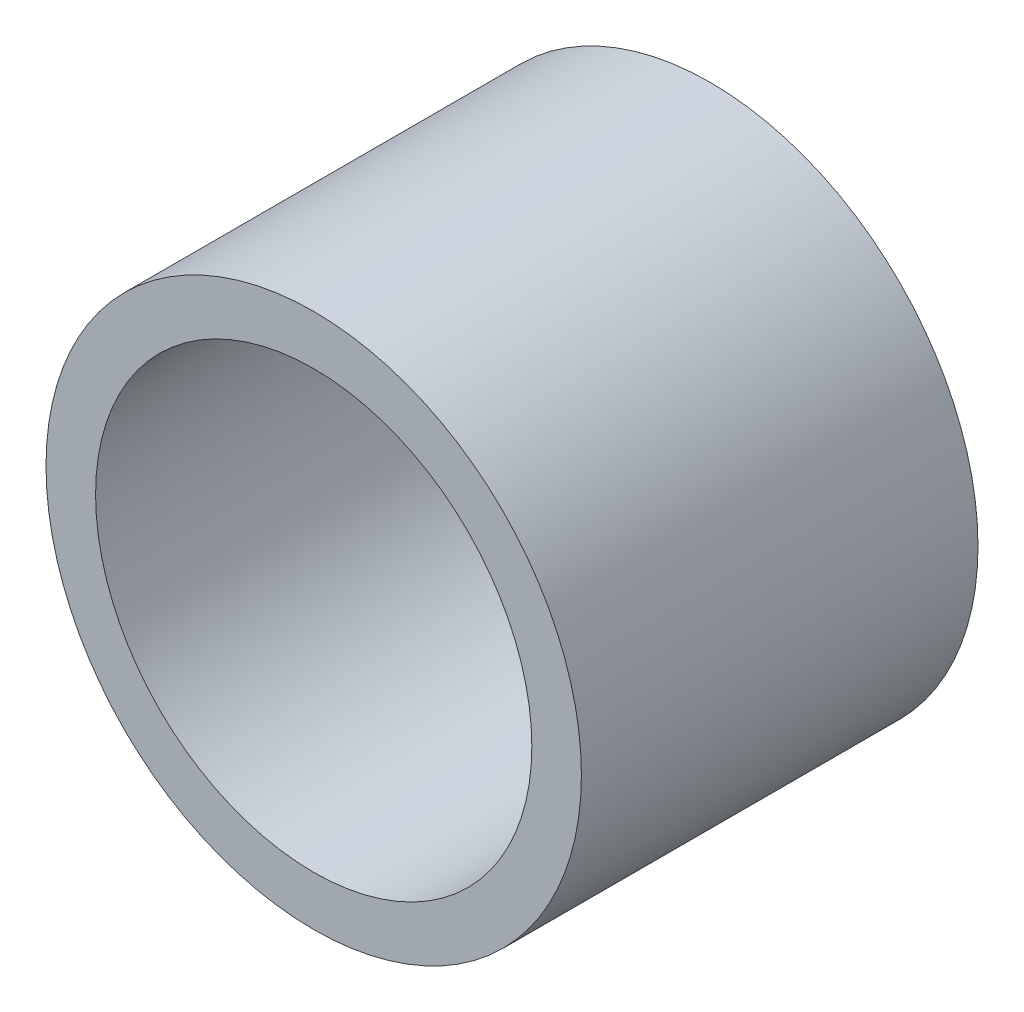
ISO-10303-21;
HEADER;
FILE_DESCRIPTION(('STEP AP214'),'2;1');
FILE_NAME('part.step','',(''),(''),'','','');
FILE_SCHEMA(('AUTOMOTIVE_DESIGN { 1 0 10303 214 1 1 1 1 }'));
ENDSEC;
DATA;
#1=APPLICATION_CONTEXT('core data for automotive mechanical design processes');
#2=APPLICATION_PROTOCOL_DEFINITION('international standard','automotive_design',2000,#1);
#3=PRODUCT_CONTEXT('',#1,'mechanical');
#4=PRODUCT('Part','Part','',(#3));
#5=PRODUCT_RELATED_PRODUCT_CATEGORY('part','',(#4));
#6=PRODUCT_DEFINITION_FORMATION('','',#4);
#7=PRODUCT_DEFINITION_CONTEXT('part definition',#1,'design');
#8=PRODUCT_DEFINITION('design','',#6,#7);
#9=PRODUCT_DEFINITION_SHAPE('','',#8);
#10=(LENGTH_UNIT() NAMED_UNIT(*) SI_UNIT(.MILLI.,.METRE.));
#11=(NAMED_UNIT(*) PLANE_ANGLE_UNIT() SI_UNIT($,.RADIAN.));
#12=(NAMED_UNIT(*) SI_UNIT($,.STERADIAN.) SOLID_ANGLE_UNIT());
#13=UNCERTAINTY_MEASURE_WITH_UNIT(LENGTH_MEASURE(1.E-05),#10,'distance_accuracy_value','');
#14=(GEOMETRIC_REPRESENTATION_CONTEXT(3) GLOBAL_UNCERTAINTY_ASSIGNED_CONTEXT((#13)) GLOBAL_UNIT_ASSIGNED_CONTEXT((#10,
#11,#12)) REPRESENTATION_CONTEXT('',''));
#15=CARTESIAN_POINT('',(0.,0.,0.));
#16=DIRECTION('',(0.,0.,1.));
#17=DIRECTION('',(1.,0.,0.));
#18=AXIS2_PLACEMENT_3D('',#15,#16,#17);
#19=CARTESIAN_POINT('',(0.,0.,20.));
#20=DIRECTION('',(0.,0.,1.));
#21=DIRECTION('',(1.,0.,0.));
#22=AXIS2_PLACEMENT_3D('',#19,#20,#21);
#23=PLANE('',#22);
#24=CARTESIAN_POINT('',(0.,0.,20.));
#25=DIRECTION('',(0.,0.,1.));
#26=DIRECTION('',(1.,0.,0.));
#27=AXIS2_PLACEMENT_3D('',#24,#25,#26);
#28=CIRCLE('',#27,13.5);
#29=CARTESIAN_POINT('',(13.5,0.,20.));
#30=VERTEX_POINT('',#29);
#31=EDGE_CURVE('E10',#30,#30,#28,.T.);
#32=ORIENTED_EDGE('',*,*,#31,.T.);
#33=EDGE_LOOP('',(#32));
#34=FACE_BOUND('',#33,.T.);
#35=CARTESIAN_POINT('',(0.,0.,20.));
#36=DIRECTION('',(0.,0.,1.));
#37=DIRECTION('',(1.,0.,0.));
#38=AXIS2_PLACEMENT_3D('',#35,#36,#37);
#39=CIRCLE('',#38,11.);
#40=CARTESIAN_POINT('',(11.,0.,20.));
#41=VERTEX_POINT('',#40);
#42=EDGE_CURVE('E50',#41,#41,#39,.T.);
#43=ORIENTED_EDGE('',*,*,#42,.F.);
#44=EDGE_LOOP('',(#43));
#45=FACE_BOUND('',#44,.T.);
#46=ADVANCED_FACE('F37',(#34,#45),#23,.T.);
#47=CARTESIAN_POINT('',(0.,0.,0.));
#48=DIRECTION('',(0.,0.,1.));
#49=DIRECTION('',(1.,0.,0.));
#50=AXIS2_PLACEMENT_3D('',#47,#48,#49);
#51=PLANE('',#50);
#52=CARTESIAN_POINT('',(0.,0.,0.));
#53=DIRECTION('',(0.,0.,1.));
#54=DIRECTION('',(1.,0.,0.));
#55=AXIS2_PLACEMENT_3D('',#52,#53,#54);
#56=CIRCLE('',#55,13.5);
#57=CARTESIAN_POINT('',(13.5,0.,0.));
#58=VERTEX_POINT('',#57);
#59=EDGE_CURVE('E41',#58,#58,#56,.T.);
#60=ORIENTED_EDGE('',*,*,#59,.F.);
#61=EDGE_LOOP('',(#60));
#62=FACE_BOUND('',#61,.T.);
#63=CARTESIAN_POINT('',(0.,0.,0.));
#64=DIRECTION('',(0.,0.,1.));
#65=DIRECTION('',(1.,0.,0.));
#66=AXIS2_PLACEMENT_3D('',#63,#64,#65);
#67=CIRCLE('',#66,11.);
#68=CARTESIAN_POINT('',(11.,0.,0.));
#69=VERTEX_POINT('',#68);
#70=EDGE_CURVE('E52',#69,#69,#67,.T.);
#71=ORIENTED_EDGE('',*,*,#70,.T.);
#72=EDGE_LOOP('',(#71));
#73=FACE_BOUND('',#72,.T.);
#74=ADVANCED_FACE('F64',(#62,#73),#51,.F.);
#75=CARTESIAN_POINT('',(0.,0.,20.));
#76=DIRECTION('',(0.,0.,-1.));
#77=DIRECTION('',(-1.,0.,0.));
#78=AXIS2_PLACEMENT_3D('',#75,#76,#77);
#79=CYLINDRICAL_SURFACE('',#78,13.5);
#80=ORIENTED_EDGE('',*,*,#31,.F.);
#81=EDGE_LOOP('',(#80));
#82=FACE_BOUND('',#81,.T.);
#83=ORIENTED_EDGE('',*,*,#59,.T.);
#84=EDGE_LOOP('',(#83));
#85=FACE_BOUND('',#84,.T.);
#86=ADVANCED_FACE('F39',(#82,#85),#79,.T.);
#87=CARTESIAN_POINT('',(0.,0.,20.));
#88=DIRECTION('',(0.,0.,-1.));
#89=DIRECTION('',(-1.,0.,0.));
#90=AXIS2_PLACEMENT_3D('',#87,#88,#89);
#91=CYLINDRICAL_SURFACE('',#90,11.);
#92=ORIENTED_EDGE('',*,*,#42,.T.);
#93=EDGE_LOOP('',(#92));
#94=FACE_BOUND('',#93,.T.);
#95=ORIENTED_EDGE('',*,*,#70,.F.);
#96=EDGE_LOOP('',(#95));
#97=FACE_BOUND('',#96,.T.);
#98=ADVANCED_FACE('F60',(#94,#97),#91,.F.);
#99=CLOSED_SHELL('',(#46,#74,#86,#98));
#100=MANIFOLD_SOLID_BREP('B2',#99);
#101=ADVANCED_BREP_SHAPE_REPRESENTATION('',(#18,#100),#14);
#102=SHAPE_DEFINITION_REPRESENTATION(#9,#101);
ENDSEC;
END-ISO-10303-21;
